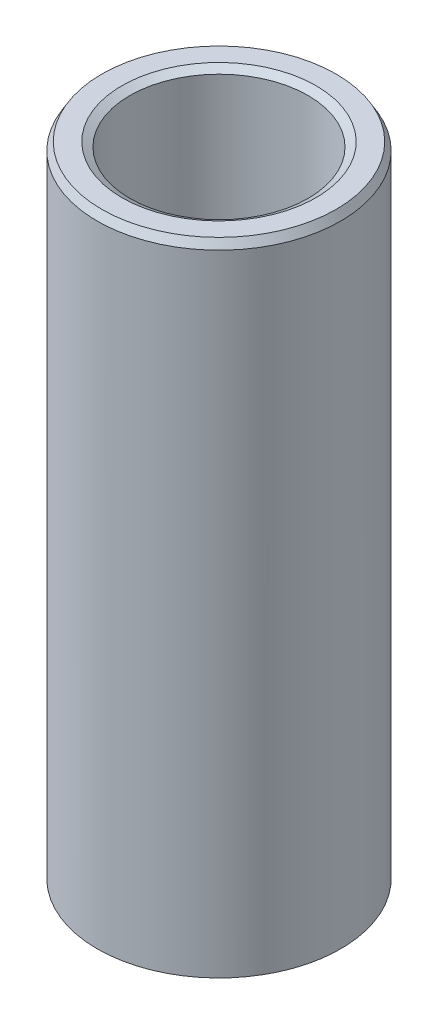
ISO-10303-21;
HEADER;
FILE_DESCRIPTION(('STEP AP214'),'2;1');
FILE_NAME('part.step','',(''),(''),'','','');
FILE_SCHEMA(('AUTOMOTIVE_DESIGN { 1 0 10303 214 1 1 1 1 }'));
ENDSEC;
DATA;
#1=APPLICATION_CONTEXT('core data for automotive mechanical design processes');
#2=APPLICATION_PROTOCOL_DEFINITION('international standard','automotive_design',2000,#1);
#3=PRODUCT_CONTEXT('',#1,'mechanical');
#4=PRODUCT('Part','Part','',(#3));
#5=PRODUCT_RELATED_PRODUCT_CATEGORY('part','',(#4));
#6=PRODUCT_DEFINITION_FORMATION('','',#4);
#7=PRODUCT_DEFINITION_CONTEXT('part definition',#1,'design');
#8=PRODUCT_DEFINITION('design','',#6,#7);
#9=PRODUCT_DEFINITION_SHAPE('','',#8);
#10=(LENGTH_UNIT() NAMED_UNIT(*) SI_UNIT(.MILLI.,.METRE.));
#11=(NAMED_UNIT(*) PLANE_ANGLE_UNIT() SI_UNIT($,.RADIAN.));
#12=(NAMED_UNIT(*) SI_UNIT($,.STERADIAN.) SOLID_ANGLE_UNIT());
#13=UNCERTAINTY_MEASURE_WITH_UNIT(LENGTH_MEASURE(1.E-05),#10,'distance_accuracy_value','');
#14=(GEOMETRIC_REPRESENTATION_CONTEXT(3) GLOBAL_UNCERTAINTY_ASSIGNED_CONTEXT((#13)) GLOBAL_UNIT_ASSIGNED_CONTEXT((#10,
#11,#12)) REPRESENTATION_CONTEXT('',''));
#15=CARTESIAN_POINT('',(0.,0.,0.));
#16=DIRECTION('',(0.,0.,1.));
#17=DIRECTION('',(1.,0.,0.));
#18=AXIS2_PLACEMENT_3D('',#15,#16,#17);
#19=CARTESIAN_POINT('',(0.,277.143206170806,0.));
#20=DIRECTION('',(0.,-1.,0.));
#21=DIRECTION('',(0.,0.,-1.));
#22=AXIS2_PLACEMENT_3D('',#19,#20,#21);
#23=CYLINDRICAL_SURFACE('',#22,52.5);
#24=CARTESIAN_POINT('',(0.,1.96651168593326,0.));
#25=DIRECTION('',(0.,1.,0.));
#26=DIRECTION('',(0.,0.,1.));
#27=AXIS2_PLACEMENT_3D('',#24,#25,#26);
#28=CIRCLE('',#27,52.5);
#29=CARTESIAN_POINT('',(0.,1.96651168593326,-52.5));
#30=VERTEX_POINT('',#29);
#31=EDGE_CURVE('E10',#30,#30,#28,.T.);
#32=CARTESIAN_POINT('',(0.,273.737108017092,0.));
#33=DIRECTION('',(0.,1.,0.));
#34=DIRECTION('',(0.,0.,1.));
#35=AXIS2_PLACEMENT_3D('',#32,#33,#34);
#36=CIRCLE('',#35,52.5);
#37=CARTESIAN_POINT('',(0.,273.737108017092,-52.5));
#38=VERTEX_POINT('',#37);
#39=EDGE_CURVE('E50',#38,#38,#36,.F.);
#40=CARTESIAN_POINT('',(0.,1.96651168593326,-52.5));
#41=CARTESIAN_POINT('',(0.,4.79745539771617,-52.5));
#42=CARTESIAN_POINT('',(0.,7.62839910949907,-52.5));
#43=CARTESIAN_POINT('',(0.,13.2902865330649,-52.5));
#44=CARTESIAN_POINT('',(0.,16.1212302448478,-52.5));
#45=CARTESIAN_POINT('',(0.,21.7831176684136,-52.5));
#46=CARTESIAN_POINT('',(0.,24.6140613801964,-52.5));
#47=CARTESIAN_POINT('',(0.,30.2759488037622,-52.5));
#48=CARTESIAN_POINT('',(0.,33.1068925155451,-52.5));
#49=CARTESIAN_POINT('',(0.,38.7687799391109,-52.5));
#50=CARTESIAN_POINT('',(0.,41.5997236508938,-52.5));
#51=CARTESIAN_POINT('',(0.,47.2616110744597,-52.5));
#52=CARTESIAN_POINT('',(0.,50.0925547862425,-52.5));
#53=CARTESIAN_POINT('',(0.,55.7544422098083,-52.5));
#54=CARTESIAN_POINT('',(0.,58.5853859215912,-52.5));
#55=CARTESIAN_POINT('',(0.,64.2472733451571,-52.5));
#56=CARTESIAN_POINT('',(0.,67.07821705694,-52.5));
#57=CARTESIAN_POINT('',(0.,72.7401044805058,-52.5));
#58=CARTESIAN_POINT('',(0.,75.5710481922887,-52.5));
#59=CARTESIAN_POINT('',(0.,81.2329356158545,-52.5));
#60=CARTESIAN_POINT('',(0.,84.0638793276374,-52.5));
#61=CARTESIAN_POINT('',(0.,89.7257667512032,-52.5));
#62=CARTESIAN_POINT('',(0.,92.5567104629861,-52.5));
#63=CARTESIAN_POINT('',(0.,98.2185978865519,-52.5));
#64=CARTESIAN_POINT('',(0.,101.049541598335,-52.5));
#65=CARTESIAN_POINT('',(0.,106.711429021901,-52.5));
#66=CARTESIAN_POINT('',(0.,109.542372733683,-52.5));
#67=CARTESIAN_POINT('',(0.,115.204260157249,-52.5));
#68=CARTESIAN_POINT('',(0.,118.035203869032,-52.5));
#69=CARTESIAN_POINT('',(0.,123.697091292598,-52.5));
#70=CARTESIAN_POINT('',(0.,126.528035004381,-52.5));
#71=CARTESIAN_POINT('',(0.,132.189922427947,-52.5));
#72=CARTESIAN_POINT('',(0.,135.02086613973,-52.5));
#73=CARTESIAN_POINT('',(0.,140.682753563295,-52.5));
#74=CARTESIAN_POINT('',(0.,143.513697275078,-52.5));
#75=CARTESIAN_POINT('',(0.,149.175584698644,-52.5));
#76=CARTESIAN_POINT('',(0.,152.006528410427,-52.5));
#77=CARTESIAN_POINT('',(0.,157.668415833993,-52.5));
#78=CARTESIAN_POINT('',(0.,160.499359545776,-52.5));
#79=CARTESIAN_POINT('',(0.,166.161246969342,-52.5));
#80=CARTESIAN_POINT('',(0.,168.992190681124,-52.5));
#81=CARTESIAN_POINT('',(0.,174.65407810469,-52.5));
#82=CARTESIAN_POINT('',(0.,177.485021816473,-52.5));
#83=CARTESIAN_POINT('',(0.,183.146909240039,-52.5));
#84=CARTESIAN_POINT('',(0.,185.977852951822,-52.5));
#85=CARTESIAN_POINT('',(0.,191.639740375388,-52.5));
#86=CARTESIAN_POINT('',(0.,194.47068408717,-52.5));
#87=CARTESIAN_POINT('',(0.,200.132571510736,-52.5));
#88=CARTESIAN_POINT('',(0.,202.963515222519,-52.5));
#89=CARTESIAN_POINT('',(0.,208.625402646085,-52.5));
#90=CARTESIAN_POINT('',(0.,211.456346357868,-52.5));
#91=CARTESIAN_POINT('',(0.,217.118233781434,-52.5));
#92=CARTESIAN_POINT('',(0.,219.949177493217,-52.5));
#93=CARTESIAN_POINT('',(0.,225.611064916782,-52.5));
#94=CARTESIAN_POINT('',(0.,228.442008628565,-52.5));
#95=CARTESIAN_POINT('',(0.,234.103896052131,-52.5));
#96=CARTESIAN_POINT('',(0.,236.934839763914,-52.5));
#97=CARTESIAN_POINT('',(0.,242.59672718748,-52.5));
#98=CARTESIAN_POINT('',(0.,245.427670899263,-52.5));
#99=CARTESIAN_POINT('',(0.,251.089558322829,-52.5));
#100=CARTESIAN_POINT('',(0.,253.920502034611,-52.5));
#101=CARTESIAN_POINT('',(0.,259.582389458177,-52.5));
#102=CARTESIAN_POINT('',(0.,262.41333316996,-52.5));
#103=CARTESIAN_POINT('',(0.,268.075220593526,-52.5));
#104=CARTESIAN_POINT('',(0.,270.906164305309,-52.5));
#105=CARTESIAN_POINT('',(0.,273.737108017092,-52.5));
#106=B_SPLINE_CURVE_WITH_KNOTS('',3,(#40,#41,#42,#43,#44,#45,#46,#47,#48,#49,#50,#51,#52,#53,
#54,#55,#56,#57,#58,#59,#60,#61,#62,#63,#64,#65,#66,#67,#68,#69,#70,#71,#72,#73,#74,#75,#76,#77,
#78,#79,#80,#81,#82,#83,#84,#85,#86,#87,#88,#89,#90,#91,#92,#93,#94,#95,#96,#97,#98,#99,#100,
#101,#102,#103,#104,#105),.UNSPECIFIED.,.F.,.F.,(4,2,2,2,2,2,2,2,2,2,2,2,2,2,2,2,2,2,2,2,2,2,2,
2,2,2,2,2,2,2,2,2,4),(0.,8.49283113534871,16.9856622706974,25.4784934060461,33.9713245413948,
42.4641556767435,50.9569868120922,59.4498179474409,67.9426490827896,76.4354802181383,
84.928311353487,93.4211424888357,101.913973624184,110.406804759533,118.899635894882,
127.392467030231,135.885298165579,144.378129300928,152.870960436277,161.363791571625,
169.856622706974,178.349453842323,186.842284977671,195.33511611302,203.827947248369,
212.320778383718,220.813609519066,229.306440654415,237.799271789764,246.292102925112,
254.784934060461,263.27776519581,271.770596331158),.UNSPECIFIED.);
#107=EDGE_CURVE('BSEAM39',#30,#38,#106,.T.);
#108=ORIENTED_EDGE('',*,*,#31,.T.);
#109=ORIENTED_EDGE('',*,*,#39,.T.);
#110=ORIENTED_EDGE('',*,*,#107,.T.);
#111=ORIENTED_EDGE('',*,*,#107,.F.);
#112=EDGE_LOOP('',(#108,#110,#109,#111));
#113=FACE_BOUND('',#112,.T.);
#114=ADVANCED_FACE('F39',(#113),#23,.T.);
#115=CARTESIAN_POINT('',(0.,277.143206170806,0.));
#116=DIRECTION('',(0.,1.,0.));
#117=DIRECTION('',(0.,0.,1.));
#118=AXIS2_PLACEMENT_3D('',#115,#116,#117);
#119=PLANE('',#118);
#120=CARTESIAN_POINT('',(0.,277.143206170806,0.));
#121=DIRECTION('',(0.,1.,0.));
#122=DIRECTION('',(0.,0.,1.));
#123=AXIS2_PLACEMENT_3D('',#120,#121,#122);
#124=CIRCLE('',#123,41.845695417404);
#125=CARTESIAN_POINT('',(0.,277.143206170806,41.845695417404));
#126=VERTEX_POINT('',#125);
#127=EDGE_CURVE('E58',#126,#126,#124,.F.);
#128=ORIENTED_EDGE('',*,*,#127,.T.);
#129=EDGE_LOOP('',(#128));
#130=FACE_BOUND('',#129,.T.);
#131=CARTESIAN_POINT('',(0.,277.143206170806,0.));
#132=DIRECTION('',(0.,1.,0.));
#133=DIRECTION('',(0.,0.,1.));
#134=AXIS2_PLACEMENT_3D('',#131,#132,#133);
#135=CIRCLE('',#134,50.533488314067);
#136=CARTESIAN_POINT('',(0.,277.143206170806,50.533488314067));
#137=VERTEX_POINT('',#136);
#138=EDGE_CURVE('E61',#137,#137,#135,.T.);
#139=ORIENTED_EDGE('',*,*,#138,.T.);
#140=EDGE_LOOP('',(#139));
#141=FACE_BOUND('',#140,.T.);
#142=ADVANCED_FACE('F88',(#130,#141),#119,.T.);
#143=CARTESIAN_POINT('',(0.,0.,0.));
#144=DIRECTION('',(0.,1.,0.));
#145=DIRECTION('',(0.,0.,1.));
#146=AXIS2_PLACEMENT_3D('',#143,#144,#145);
#147=PLANE('',#146);
#148=CARTESIAN_POINT('',(0.,0.,0.));
#149=DIRECTION('',(0.,1.,0.));
#150=DIRECTION('',(0.,0.,1.));
#151=AXIS2_PLACEMENT_3D('',#148,#149,#150);
#152=CIRCLE('',#151,40.4061089496228);
#153=CARTESIAN_POINT('',(0.,0.,40.4061089496228));
#154=VERTEX_POINT('',#153);
#155=EDGE_CURVE('E51',#154,#154,#152,.T.);
#156=ORIENTED_EDGE('',*,*,#155,.T.);
#157=EDGE_LOOP('',(#156));
#158=FACE_BOUND('',#157,.T.);
#159=CARTESIAN_POINT('',(0.,0.,0.));
#160=DIRECTION('',(0.,1.,0.));
#161=DIRECTION('',(0.,0.,1.));
#162=AXIS2_PLACEMENT_3D('',#159,#160,#161);
#163=CIRCLE('',#162,49.0939018462857);
#164=CARTESIAN_POINT('',(0.,0.,49.0939018462857));
#165=VERTEX_POINT('',#164);
#166=EDGE_CURVE('E54',#165,#165,#163,.F.);
#167=ORIENTED_EDGE('',*,*,#166,.T.);
#168=EDGE_LOOP('',(#167));
#169=FACE_BOUND('',#168,.T.);
#170=ADVANCED_FACE('F83',(#158,#169),#147,.F.);
#171=CARTESIAN_POINT('',(0.,277.143206170806,0.));
#172=DIRECTION('',(0.,-1.,0.));
#173=DIRECTION('',(0.,0.,-1.));
#174=AXIS2_PLACEMENT_3D('',#171,#172,#173);
#175=CYLINDRICAL_SURFACE('',#174,38.4395972636897);
#176=CARTESIAN_POINT('',(0.,275.176694484872,0.));
#177=DIRECTION('',(0.,1.,0.));
#178=DIRECTION('',(0.,0.,1.));
#179=AXIS2_PLACEMENT_3D('',#176,#177,#178);
#180=CIRCLE('',#179,38.4395972636897);
#181=CARTESIAN_POINT('',(0.,275.176694484872,-38.4395972636897));
#182=VERTEX_POINT('',#181);
#183=EDGE_CURVE('E67',#182,#182,#180,.T.);
#184=CARTESIAN_POINT('',(0.,3.40609815371412,0.));
#185=DIRECTION('',(0.,1.,0.));
#186=DIRECTION('',(0.,0.,1.));
#187=AXIS2_PLACEMENT_3D('',#184,#185,#186);
#188=CIRCLE('',#187,38.4395972636897);
#189=CARTESIAN_POINT('',(0.,3.40609815371412,-38.4395972636897));
#190=VERTEX_POINT('',#189);
#191=EDGE_CURVE('E69',#190,#190,#188,.F.);
#192=CARTESIAN_POINT('',(0.,275.176694484872,-38.4395972636897));
#193=CARTESIAN_POINT('',(0.,272.345750773089,-38.4395972636897));
#194=CARTESIAN_POINT('',(0.,269.514807061306,-38.4395972636897));
#195=CARTESIAN_POINT('',(0.,263.852919637741,-38.4395972636897));
#196=CARTESIAN_POINT('',(0.,261.021975925958,-38.4395972636897));
#197=CARTESIAN_POINT('',(0.,255.360088502392,-38.4395972636897));
#198=CARTESIAN_POINT('',(0.,252.529144790609,-38.4395972636897));
#199=CARTESIAN_POINT('',(0.,246.867257367043,-38.4395972636897));
#200=CARTESIAN_POINT('',(0.,244.03631365526,-38.4395972636897));
#201=CARTESIAN_POINT('',(0.,238.374426231695,-38.4395972636897));
#202=CARTESIAN_POINT('',(0.,235.543482519912,-38.4395972636897));
#203=CARTESIAN_POINT('',(0.,229.881595096346,-38.4395972636897));
#204=CARTESIAN_POINT('',(0.,227.050651384563,-38.4395972636897));
#205=CARTESIAN_POINT('',(0.,221.388763960997,-38.4395972636897));
#206=CARTESIAN_POINT('',(0.,218.557820249214,-38.4395972636897));
#207=CARTESIAN_POINT('',(0.,212.895932825649,-38.4395972636897));
#208=CARTESIAN_POINT('',(0.,210.064989113866,-38.4395972636897));
#209=CARTESIAN_POINT('',(0.,204.4031016903,-38.4395972636897));
#210=CARTESIAN_POINT('',(0.,201.572157978517,-38.4395972636897));
#211=CARTESIAN_POINT('',(0.,195.910270554951,-38.4395972636897));
#212=CARTESIAN_POINT('',(0.,193.079326843168,-38.4395972636897));
#213=CARTESIAN_POINT('',(0.,187.417439419602,-38.4395972636897));
#214=CARTESIAN_POINT('',(0.,184.58649570782,-38.4395972636897));
#215=CARTESIAN_POINT('',(0.,178.924608284254,-38.4395972636897));
#216=CARTESIAN_POINT('',(0.,176.093664572471,-38.4395972636897));
#217=CARTESIAN_POINT('',(0.,170.431777148905,-38.4395972636897));
#218=CARTESIAN_POINT('',(0.,167.600833437122,-38.4395972636897));
#219=CARTESIAN_POINT('',(0.,161.938946013556,-38.4395972636897));
#220=CARTESIAN_POINT('',(0.,159.108002301773,-38.4395972636897));
#221=CARTESIAN_POINT('',(0.,153.446114878208,-38.4395972636897));
#222=CARTESIAN_POINT('',(0.,150.615171166425,-38.4395972636897));
#223=CARTESIAN_POINT('',(0.,144.953283742859,-38.4395972636897));
#224=CARTESIAN_POINT('',(0.,142.122340031076,-38.4395972636897));
#225=CARTESIAN_POINT('',(0.,136.46045260751,-38.4395972636897));
#226=CARTESIAN_POINT('',(0.,133.629508895727,-38.4395972636897));
#227=CARTESIAN_POINT('',(0.,127.967621472162,-38.4395972636897));
#228=CARTESIAN_POINT('',(0.,125.136677760379,-38.4395972636897));
#229=CARTESIAN_POINT('',(0.,119.474790336813,-38.4395972636897));
#230=CARTESIAN_POINT('',(0.,116.64384662503,-38.4395972636897));
#231=CARTESIAN_POINT('',(0.,110.981959201464,-38.4395972636897));
#232=CARTESIAN_POINT('',(0.,108.151015489681,-38.4395972636897));
#233=CARTESIAN_POINT('',(0.,102.489128066116,-38.4395972636897));
#234=CARTESIAN_POINT('',(0.,99.6581843543326,-38.4395972636897));
#235=CARTESIAN_POINT('',(0.,93.9962969307668,-38.4395972636897));
#236=CARTESIAN_POINT('',(0.,91.165353218984,-38.4395972636897));
#237=CARTESIAN_POINT('',(0.,85.5034657954182,-38.4395972636897));
#238=CARTESIAN_POINT('',(0.,82.6725220836352,-38.4395972636897));
#239=CARTESIAN_POINT('',(0.,77.0106346600695,-38.4395972636897));
#240=CARTESIAN_POINT('',(0.,74.1796909482866,-38.4395972636897));
#241=CARTESIAN_POINT('',(0.,68.5178035247208,-38.4395972636897));
#242=CARTESIAN_POINT('',(0.,65.6868598129379,-38.4395972636897));
#243=CARTESIAN_POINT('',(0.,60.0249723893721,-38.4395972636897));
#244=CARTESIAN_POINT('',(0.,57.1940286775892,-38.4395972636897));
#245=CARTESIAN_POINT('',(0.,51.5321412540234,-38.4395972636897));
#246=CARTESIAN_POINT('',(0.,48.7011975422405,-38.4395972636897));
#247=CARTESIAN_POINT('',(0.,43.0393101186747,-38.4395972636897));
#248=CARTESIAN_POINT('',(0.,40.2083664068918,-38.4395972636897));
#249=CARTESIAN_POINT('',(0.,34.546478983326,-38.4395972636897));
#250=CARTESIAN_POINT('',(0.,31.7155352715431,-38.4395972636897));
#251=CARTESIAN_POINT('',(0.,26.0536478479773,-38.4395972636897));
#252=CARTESIAN_POINT('',(0.,23.2227041361944,-38.4395972636897));
#253=CARTESIAN_POINT('',(0.,17.5608167126286,-38.4395972636897));
#254=CARTESIAN_POINT('',(0.,14.7298730008457,-38.4395972636897));
#255=CARTESIAN_POINT('',(0.,9.06798557727993,-38.4395972636897));
#256=CARTESIAN_POINT('',(0.,6.23704186549703,-38.4395972636897));
#257=CARTESIAN_POINT('',(0.,3.40609815371412,-38.4395972636897));
#258=B_SPLINE_CURVE_WITH_KNOTS('',3,(#192,#193,#194,#195,#196,#197,#198,#199,#200,#201,#202,
#203,#204,#205,#206,#207,#208,#209,#210,#211,#212,#213,#214,#215,#216,#217,#218,#219,#220,#221,
#222,#223,#224,#225,#226,#227,#228,#229,#230,#231,#232,#233,#234,#235,#236,#237,#238,#239,#240,
#241,#242,#243,#244,#245,#246,#247,#248,#249,#250,#251,#252,#253,#254,#255,#256,#257),
.UNSPECIFIED.,.F.,.F.,(4,2,2,2,2,2,2,2,2,2,2,2,2,2,2,2,2,2,2,2,2,2,2,2,2,2,2,2,2,2,2,2,4),(0.,
8.49283113534871,16.9856622706974,25.4784934060461,33.9713245413948,42.4641556767435,
50.9569868120922,59.4498179474409,67.9426490827896,76.4354802181383,84.9283113534869,
93.4211424888357,101.913973624184,110.406804759533,118.899635894882,127.39246703023,
135.885298165579,144.378129300928,152.870960436276,161.363791571625,169.856622706974,
178.349453842323,186.842284977671,195.33511611302,203.827947248369,212.320778383717,
220.813609519066,229.306440654415,237.799271789763,246.292102925112,254.784934060461,
263.277765195809,271.770596331158),.UNSPECIFIED.);
#259=EDGE_CURVE('BSEAM71',#182,#190,#258,.T.);
#260=ORIENTED_EDGE('',*,*,#183,.T.);
#261=ORIENTED_EDGE('',*,*,#191,.T.);
#262=ORIENTED_EDGE('',*,*,#259,.T.);
#263=ORIENTED_EDGE('',*,*,#259,.F.);
#264=EDGE_LOOP('',(#260,#262,#261,#263));
#265=FACE_BOUND('',#264,.T.);
#266=ADVANCED_FACE('F71',(#265),#175,.F.);
#267=CARTESIAN_POINT('',(0.,275.176694484872,0.));
#268=DIRECTION('',(0.,1.,0.));
#269=DIRECTION('',(0.,0.,1.));
#270=AXIS2_PLACEMENT_3D('',#267,#268,#269);
#271=CONICAL_SURFACE('',#270,38.4395972636897,1.04719755119659);
#272=ORIENTED_EDGE('',*,*,#127,.F.);
#273=EDGE_LOOP('',(#272));
#274=FACE_BOUND('',#273,.T.);
#275=ORIENTED_EDGE('',*,*,#183,.F.);
#276=EDGE_LOOP('',(#275));
#277=FACE_BOUND('',#276,.T.);
#278=ADVANCED_FACE('F77',(#274,#277),#271,.F.);
#279=CARTESIAN_POINT('',(0.,0.,0.));
#280=DIRECTION('',(0.,-1.,0.));
#281=DIRECTION('',(0.,0.,-1.));
#282=AXIS2_PLACEMENT_3D('',#279,#280,#281);
#283=CONICAL_SURFACE('',#282,40.4061089496228,0.523598775598292);
#284=ORIENTED_EDGE('',*,*,#191,.F.);
#285=EDGE_LOOP('',(#284));
#286=FACE_BOUND('',#285,.T.);
#287=ORIENTED_EDGE('',*,*,#155,.F.);
#288=EDGE_LOOP('',(#287));
#289=FACE_BOUND('',#288,.T.);
#290=ADVANCED_FACE('F73',(#286,#289),#283,.F.);
#291=CARTESIAN_POINT('',(0.,1.96651168593326,0.));
#292=DIRECTION('',(0.,1.,0.));
#293=DIRECTION('',(0.,0.,1.));
#294=AXIS2_PLACEMENT_3D('',#291,#292,#293);
#295=CONICAL_SURFACE('',#294,52.5,1.04719755119659);
#296=ORIENTED_EDGE('',*,*,#166,.F.);
#297=EDGE_LOOP('',(#296));
#298=FACE_BOUND('',#297,.T.);
#299=ORIENTED_EDGE('',*,*,#31,.F.);
#300=EDGE_LOOP('',(#299));
#301=FACE_BOUND('',#300,.T.);
#302=ADVANCED_FACE('F76',(#298,#301),#295,.T.);
#303=CARTESIAN_POINT('',(0.,277.143206170806,0.));
#304=DIRECTION('',(0.,-1.,0.));
#305=DIRECTION('',(0.,0.,-1.));
#306=AXIS2_PLACEMENT_3D('',#303,#304,#305);
#307=CONICAL_SURFACE('',#306,50.533488314067,0.523598775598303);
#308=ORIENTED_EDGE('',*,*,#39,.F.);
#309=EDGE_LOOP('',(#308));
#310=FACE_BOUND('',#309,.T.);
#311=ORIENTED_EDGE('',*,*,#138,.F.);
#312=EDGE_LOOP('',(#311));
#313=FACE_BOUND('',#312,.T.);
#314=ADVANCED_FACE('F45',(#310,#313),#307,.T.);
#315=CLOSED_SHELL('',(#114,#142,#170,#266,#278,#290,#302,#314));
#316=MANIFOLD_SOLID_BREP('B2',#315);
#317=ADVANCED_BREP_SHAPE_REPRESENTATION('',(#18,#316),#14);
#318=SHAPE_DEFINITION_REPRESENTATION(#9,#317);
ENDSEC;
END-ISO-10303-21;
